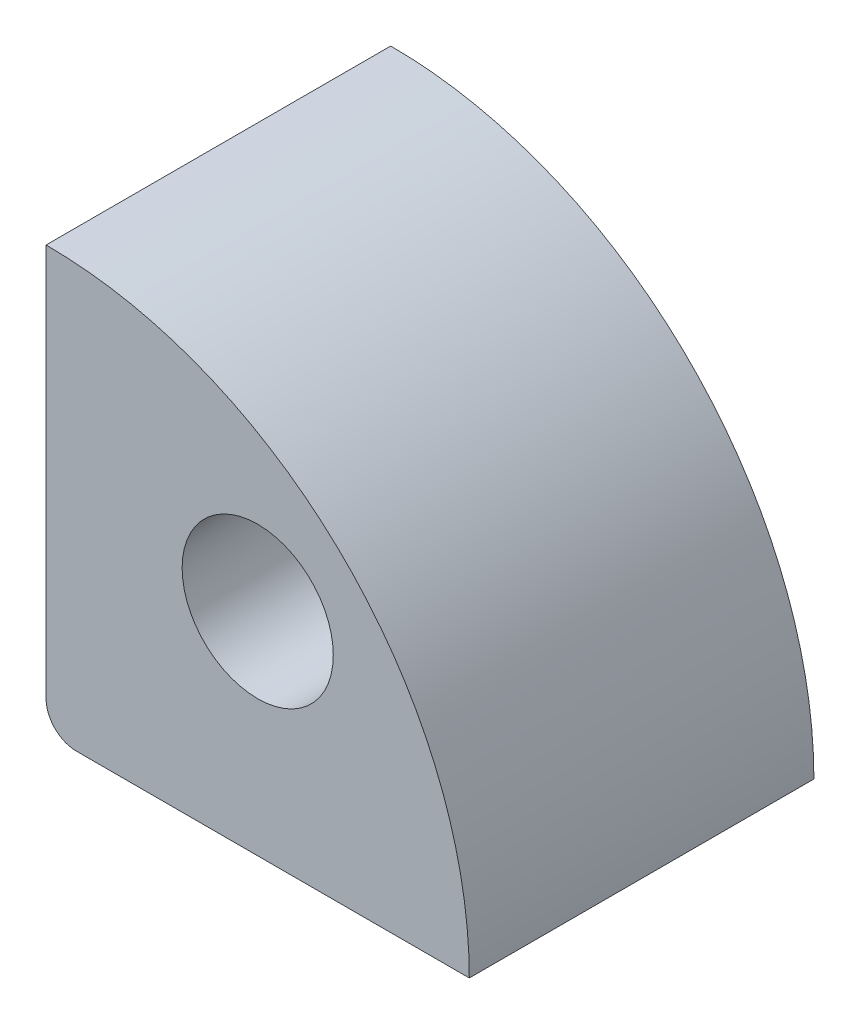
ISO-10303-21;
HEADER;
FILE_DESCRIPTION(('STEP AP214'),'2;1');
FILE_NAME('part.step','',(''),(''),'','','');
FILE_SCHEMA(('AUTOMOTIVE_DESIGN { 1 0 10303 214 1 1 1 1 }'));
ENDSEC;
DATA;
#1=APPLICATION_CONTEXT('core data for automotive mechanical design processes');
#2=APPLICATION_PROTOCOL_DEFINITION('international standard','automotive_design',2000,#1);
#3=PRODUCT_CONTEXT('',#1,'mechanical');
#4=PRODUCT('Part','Part','',(#3));
#5=PRODUCT_RELATED_PRODUCT_CATEGORY('part','',(#4));
#6=PRODUCT_DEFINITION_FORMATION('','',#4);
#7=PRODUCT_DEFINITION_CONTEXT('part definition',#1,'design');
#8=PRODUCT_DEFINITION('design','',#6,#7);
#9=PRODUCT_DEFINITION_SHAPE('','',#8);
#10=(LENGTH_UNIT() NAMED_UNIT(*) SI_UNIT(.MILLI.,.METRE.));
#11=(NAMED_UNIT(*) PLANE_ANGLE_UNIT() SI_UNIT($,.RADIAN.));
#12=(NAMED_UNIT(*) SI_UNIT($,.STERADIAN.) SOLID_ANGLE_UNIT());
#13=UNCERTAINTY_MEASURE_WITH_UNIT(LENGTH_MEASURE(1.E-05),#10,'distance_accuracy_value','');
#14=(GEOMETRIC_REPRESENTATION_CONTEXT(3) GLOBAL_UNCERTAINTY_ASSIGNED_CONTEXT((#13)) GLOBAL_UNIT_ASSIGNED_CONTEXT((#10,
#11,#12)) REPRESENTATION_CONTEXT('',''));
#15=CARTESIAN_POINT('',(0.,0.,0.));
#16=DIRECTION('',(0.,0.,1.));
#17=DIRECTION('',(1.,0.,0.));
#18=AXIS2_PLACEMENT_3D('',#15,#16,#17);
#19=CARTESIAN_POINT('',(0.,0.,5.7));
#20=DIRECTION('',(1.,0.,0.));
#21=DIRECTION('',(0.,0.,-1.));
#22=AXIS2_PLACEMENT_3D('',#19,#20,#21);
#23=PLANE('',#22);
#24=DIRECTION('',(0.,-1.,0.));
#25=VECTOR('',#24,1.);
#26=CARTESIAN_POINT('',(0.,0.,0.));
#27=LINE('',#26,#25);
#28=CARTESIAN_POINT('',(0.,7.,0.));
#29=VERTEX_POINT('',#28);
#30=CARTESIAN_POINT('',(0.,0.5,0.));
#31=VERTEX_POINT('',#30);
#32=EDGE_CURVE('E100',#29,#31,#27,.T.);
#33=ORIENTED_EDGE('',*,*,#32,.T.);
#34=DIRECTION('',(0.,0.,-1.));
#35=VECTOR('',#34,1.);
#36=CARTESIAN_POINT('',(0.,0.5,5.7));
#37=LINE('',#36,#35);
#38=CARTESIAN_POINT('',(0.,0.5,5.7));
#39=VERTEX_POINT('',#38);
#40=EDGE_CURVE('E41',#31,#39,#37,.F.);
#41=ORIENTED_EDGE('',*,*,#40,.T.);
#42=DIRECTION('',(0.,-1.,0.));
#43=VECTOR('',#42,1.);
#44=CARTESIAN_POINT('',(0.,0.,5.7));
#45=LINE('',#44,#43);
#46=CARTESIAN_POINT('',(0.,7.,5.7));
#47=VERTEX_POINT('',#46);
#48=EDGE_CURVE('E83',#47,#39,#45,.T.);
#49=ORIENTED_EDGE('',*,*,#48,.F.);
#50=DIRECTION('',(0.,0.,-1.));
#51=VECTOR('',#50,1.);
#52=CARTESIAN_POINT('',(0.,7.,5.7));
#53=LINE('',#52,#51);
#54=EDGE_CURVE('E92',#47,#29,#53,.T.);
#55=ORIENTED_EDGE('',*,*,#54,.T.);
#56=EDGE_LOOP('',(#33,#41,#49,#55));
#57=FACE_BOUND('',#56,.T.);
#58=ADVANCED_FACE('F33',(#57),#23,.F.);
#59=CARTESIAN_POINT('',(0.,0.,5.7));
#60=DIRECTION('',(0.,1.,0.));
#61=DIRECTION('',(0.,0.,1.));
#62=AXIS2_PLACEMENT_3D('',#59,#60,#61);
#63=PLANE('',#62);
#64=DIRECTION('',(1.,0.,0.));
#65=VECTOR('',#64,1.);
#66=CARTESIAN_POINT('',(0.,0.,5.7));
#67=LINE('',#66,#65);
#68=CARTESIAN_POINT('',(0.5,0.,5.7));
#69=VERTEX_POINT('',#68);
#70=CARTESIAN_POINT('',(7.,0.,5.7));
#71=VERTEX_POINT('',#70);
#72=EDGE_CURVE('E73',#69,#71,#67,.T.);
#73=ORIENTED_EDGE('',*,*,#72,.F.);
#74=DIRECTION('',(0.,0.,-1.));
#75=VECTOR('',#74,1.);
#76=CARTESIAN_POINT('',(0.5,0.,5.7));
#77=LINE('',#76,#75);
#78=CARTESIAN_POINT('',(0.5,0.,0.));
#79=VERTEX_POINT('',#78);
#80=EDGE_CURVE('E91',#69,#79,#77,.T.);
#81=ORIENTED_EDGE('',*,*,#80,.T.);
#82=DIRECTION('',(1.,0.,0.));
#83=VECTOR('',#82,1.);
#84=CARTESIAN_POINT('',(0.,0.,0.));
#85=LINE('',#84,#83);
#86=CARTESIAN_POINT('',(7.,0.,0.));
#87=VERTEX_POINT('',#86);
#88=EDGE_CURVE('E88',#79,#87,#85,.T.);
#89=ORIENTED_EDGE('',*,*,#88,.T.);
#90=DIRECTION('',(0.,0.,-1.));
#91=VECTOR('',#90,1.);
#92=CARTESIAN_POINT('',(7.,0.,5.7));
#93=LINE('',#92,#91);
#94=EDGE_CURVE('E86',#71,#87,#93,.T.);
#95=ORIENTED_EDGE('',*,*,#94,.F.);
#96=EDGE_LOOP('',(#73,#81,#89,#95));
#97=FACE_BOUND('',#96,.T.);
#98=ADVANCED_FACE('F87',(#97),#63,.F.);
#99=CARTESIAN_POINT('',(0.,0.,5.7));
#100=DIRECTION('',(0.,0.,-1.));
#101=DIRECTION('',(-1.,0.,0.));
#102=AXIS2_PLACEMENT_3D('',#99,#100,#101);
#103=CYLINDRICAL_SURFACE('',#102,7.);
#104=CARTESIAN_POINT('',(0.,0.,0.));
#105=DIRECTION('',(0.,0.,1.));
#106=DIRECTION('',(1.,0.,0.));
#107=AXIS2_PLACEMENT_3D('',#104,#105,#106);
#108=CIRCLE('',#107,7.);
#109=EDGE_CURVE('E104',#87,#29,#108,.T.);
#110=ORIENTED_EDGE('',*,*,#109,.T.);
#111=ORIENTED_EDGE('',*,*,#54,.F.);
#112=CARTESIAN_POINT('',(0.,0.,5.7));
#113=DIRECTION('',(0.,0.,1.));
#114=DIRECTION('',(1.,0.,0.));
#115=AXIS2_PLACEMENT_3D('',#112,#113,#114);
#116=CIRCLE('',#115,7.);
#117=EDGE_CURVE('E77',#71,#47,#116,.T.);
#118=ORIENTED_EDGE('',*,*,#117,.F.);
#119=ORIENTED_EDGE('',*,*,#94,.T.);
#120=EDGE_LOOP('',(#110,#111,#118,#119));
#121=FACE_BOUND('',#120,.T.);
#122=ADVANCED_FACE('F94',(#121),#103,.T.);
#123=CARTESIAN_POINT('',(0.,0.,5.7));
#124=DIRECTION('',(0.,0.,1.));
#125=DIRECTION('',(1.,0.,0.));
#126=AXIS2_PLACEMENT_3D('',#123,#124,#125);
#127=PLANE('',#126);
#128=CARTESIAN_POINT('',(3.5001785668734,3.50017856687342,5.7));
#129=DIRECTION('',(0.,0.,1.));
#130=DIRECTION('',(1.,0.,0.));
#131=AXIS2_PLACEMENT_3D('',#128,#129,#130);
#132=CIRCLE('',#131,1.25);
#133=CARTESIAN_POINT('',(4.7501785668734,3.50017856687342,5.7));
#134=VERTEX_POINT('',#133);
#135=EDGE_CURVE('E110',#134,#134,#132,.T.);
#136=ORIENTED_EDGE('',*,*,#135,.F.);
#137=EDGE_LOOP('',(#136));
#138=FACE_BOUND('',#137,.T.);
#139=ORIENTED_EDGE('',*,*,#48,.T.);
#140=CARTESIAN_POINT('',(0.5,0.5,5.7));
#141=DIRECTION('',(0.,0.,1.));
#142=DIRECTION('',(1.,0.,0.));
#143=AXIS2_PLACEMENT_3D('',#140,#141,#142);
#144=CIRCLE('',#143,0.5);
#145=EDGE_CURVE('E11',#39,#69,#144,.T.);
#146=ORIENTED_EDGE('',*,*,#145,.T.);
#147=ORIENTED_EDGE('',*,*,#72,.T.);
#148=ORIENTED_EDGE('',*,*,#117,.T.);
#149=EDGE_LOOP('',(#139,#146,#147,#148));
#150=FACE_BOUND('',#149,.T.);
#151=ADVANCED_FACE('F75',(#138,#150),#127,.T.);
#152=CARTESIAN_POINT('',(0.,0.,0.));
#153=DIRECTION('',(0.,0.,1.));
#154=DIRECTION('',(1.,0.,0.));
#155=AXIS2_PLACEMENT_3D('',#152,#153,#154);
#156=PLANE('',#155);
#157=CARTESIAN_POINT('',(3.5001785668734,3.50017856687342,0.));
#158=DIRECTION('',(0.,0.,1.));
#159=DIRECTION('',(1.,0.,0.));
#160=AXIS2_PLACEMENT_3D('',#157,#158,#159);
#161=CIRCLE('',#160,1.25);
#162=CARTESIAN_POINT('',(4.7501785668734,3.50017856687342,0.));
#163=VERTEX_POINT('',#162);
#164=EDGE_CURVE('E102',#163,#163,#161,.T.);
#165=ORIENTED_EDGE('',*,*,#164,.T.);
#166=EDGE_LOOP('',(#165));
#167=FACE_BOUND('',#166,.T.);
#168=ORIENTED_EDGE('',*,*,#88,.F.);
#169=CARTESIAN_POINT('',(0.5,0.5,0.));
#170=DIRECTION('',(0.,0.,1.));
#171=DIRECTION('',(1.,0.,0.));
#172=AXIS2_PLACEMENT_3D('',#169,#170,#171);
#173=CIRCLE('',#172,0.5);
#174=EDGE_CURVE('E55',#79,#31,#173,.F.);
#175=ORIENTED_EDGE('',*,*,#174,.T.);
#176=ORIENTED_EDGE('',*,*,#32,.F.);
#177=ORIENTED_EDGE('',*,*,#109,.F.);
#178=EDGE_LOOP('',(#168,#175,#176,#177));
#179=FACE_BOUND('',#178,.T.);
#180=ADVANCED_FACE('F108',(#167,#179),#156,.F.);
#181=CARTESIAN_POINT('',(3.5001785668734,3.50017856687342,0.));
#182=DIRECTION('',(0.,0.,1.));
#183=DIRECTION('',(1.,0.,0.));
#184=AXIS2_PLACEMENT_3D('',#181,#182,#183);
#185=CYLINDRICAL_SURFACE('',#184,1.25);
#186=ORIENTED_EDGE('',*,*,#164,.F.);
#187=EDGE_LOOP('',(#186));
#188=FACE_BOUND('',#187,.T.);
#189=ORIENTED_EDGE('',*,*,#135,.T.);
#190=EDGE_LOOP('',(#189));
#191=FACE_BOUND('',#190,.T.);
#192=ADVANCED_FACE('F117',(#188,#191),#185,.F.);
#193=CARTESIAN_POINT('',(0.5,0.5,5.7));
#194=DIRECTION('',(0.,0.,-1.));
#195=DIRECTION('',(-1.,0.,0.));
#196=AXIS2_PLACEMENT_3D('',#193,#194,#195);
#197=CYLINDRICAL_SURFACE('',#196,0.5);
#198=ORIENTED_EDGE('',*,*,#145,.F.);
#199=ORIENTED_EDGE('',*,*,#40,.F.);
#200=ORIENTED_EDGE('',*,*,#174,.F.);
#201=ORIENTED_EDGE('',*,*,#80,.F.);
#202=EDGE_LOOP('',(#198,#199,#200,#201));
#203=FACE_BOUND('',#202,.T.);
#204=ADVANCED_FACE('F35',(#203),#197,.T.);
#205=CLOSED_SHELL('',(#58,#98,#122,#151,#180,#192,#204));
#206=MANIFOLD_SOLID_BREP('B2',#205);
#207=ADVANCED_BREP_SHAPE_REPRESENTATION('',(#18,#206),#14);
#208=SHAPE_DEFINITION_REPRESENTATION(#9,#207);
ENDSEC;
END-ISO-10303-21;
